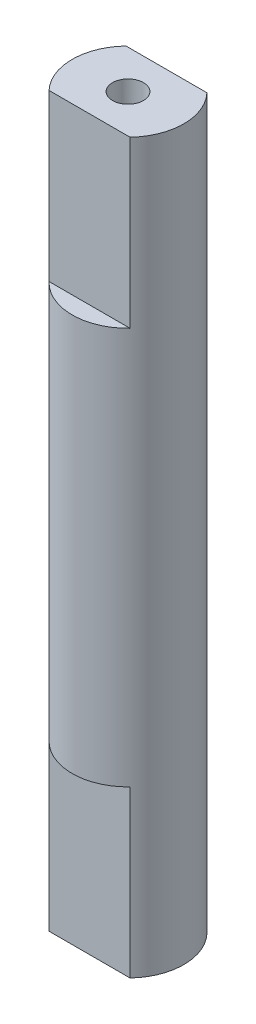
ISO-10303-21;
HEADER;
FILE_DESCRIPTION(('STEP AP214'),'2;1');
FILE_NAME('part.step','',(''),(''),'','','');
FILE_SCHEMA(('AUTOMOTIVE_DESIGN { 1 0 10303 214 1 1 1 1 }'));
ENDSEC;
DATA;
#1=APPLICATION_CONTEXT('core data for automotive mechanical design processes');
#2=APPLICATION_PROTOCOL_DEFINITION('international standard','automotive_design',2000,#1);
#3=PRODUCT_CONTEXT('',#1,'mechanical');
#4=PRODUCT('Part','Part','',(#3));
#5=PRODUCT_RELATED_PRODUCT_CATEGORY('part','',(#4));
#6=PRODUCT_DEFINITION_FORMATION('','',#4);
#7=PRODUCT_DEFINITION_CONTEXT('part definition',#1,'design');
#8=PRODUCT_DEFINITION('design','',#6,#7);
#9=PRODUCT_DEFINITION_SHAPE('','',#8);
#10=(LENGTH_UNIT() NAMED_UNIT(*) SI_UNIT(.MILLI.,.METRE.));
#11=(NAMED_UNIT(*) PLANE_ANGLE_UNIT() SI_UNIT($,.RADIAN.));
#12=(NAMED_UNIT(*) SI_UNIT($,.STERADIAN.) SOLID_ANGLE_UNIT());
#13=UNCERTAINTY_MEASURE_WITH_UNIT(LENGTH_MEASURE(1.E-05),#10,'distance_accuracy_value','');
#14=(GEOMETRIC_REPRESENTATION_CONTEXT(3) GLOBAL_UNCERTAINTY_ASSIGNED_CONTEXT((#13)) GLOBAL_UNIT_ASSIGNED_CONTEXT((#10,
#11,#12)) REPRESENTATION_CONTEXT('',''));
#15=CARTESIAN_POINT('',(0.,0.,0.));
#16=DIRECTION('',(0.,0.,1.));
#17=DIRECTION('',(1.,0.,0.));
#18=AXIS2_PLACEMENT_3D('',#15,#16,#17);
#19=CARTESIAN_POINT('',(0.,24.6045340050378,0.));
#20=DIRECTION('',(0.,1.,0.));
#21=DIRECTION('',(0.,0.,1.));
#22=AXIS2_PLACEMENT_3D('',#19,#20,#21);
#23=CYLINDRICAL_SURFACE('',#22,2.69999999999999);
#24=DIRECTION('',(0.,1.,0.));
#25=VECTOR('',#24,1.);
#26=CARTESIAN_POINT('',(-1.957140771636,24.6045340050378,1.86));
#27=LINE('',#26,#25);
#28=CARTESIAN_POINT('',(-1.957140771636,17.6,1.86));
#29=VERTEX_POINT('',#28);
#30=CARTESIAN_POINT('',(-1.957140771636,9.6,1.86));
#31=VERTEX_POINT('',#30);
#32=EDGE_CURVE('E138',#29,#31,#27,.F.);
#33=ORIENTED_EDGE('',*,*,#32,.F.);
#34=CARTESIAN_POINT('',(0.,17.6,0.));
#35=DIRECTION('',(0.,1.,0.));
#36=DIRECTION('',(0.,0.,1.));
#37=AXIS2_PLACEMENT_3D('',#34,#35,#36);
#38=CIRCLE('',#37,2.69999999999999);
#39=CARTESIAN_POINT('',(-1.957140771636,17.6,-1.86));
#40=VERTEX_POINT('',#39);
#41=EDGE_CURVE('E124',#40,#29,#38,.T.);
#42=ORIENTED_EDGE('',*,*,#41,.F.);
#43=DIRECTION('',(0.,1.,0.));
#44=VECTOR('',#43,1.);
#45=CARTESIAN_POINT('',(-1.957140771636,24.6045340050378,-1.86));
#46=LINE('',#45,#44);
#47=CARTESIAN_POINT('',(-1.957140771636,9.6,-1.86));
#48=VERTEX_POINT('',#47);
#49=EDGE_CURVE('E129',#48,#40,#46,.T.);
#50=ORIENTED_EDGE('',*,*,#49,.F.);
#51=CARTESIAN_POINT('',(0.,9.6,0.));
#52=DIRECTION('',(0.,-1.,0.));
#53=DIRECTION('',(0.,0.,-1.));
#54=AXIS2_PLACEMENT_3D('',#51,#52,#53);
#55=CIRCLE('',#54,2.69999999999999);
#56=CARTESIAN_POINT('',(1.957140771636,9.6,-1.86));
#57=VERTEX_POINT('',#56);
#58=EDGE_CURVE('E127',#57,#48,#55,.F.);
#59=ORIENTED_EDGE('',*,*,#58,.F.);
#60=DIRECTION('',(0.,1.,0.));
#61=VECTOR('',#60,1.);
#62=CARTESIAN_POINT('',(1.957140771636,24.6045340050378,-1.86));
#63=LINE('',#62,#61);
#64=CARTESIAN_POINT('',(1.957140771636,17.6,-1.86));
#65=VERTEX_POINT('',#64);
#66=EDGE_CURVE('E131',#65,#57,#63,.F.);
#67=ORIENTED_EDGE('',*,*,#66,.F.);
#68=CARTESIAN_POINT('',(1.957140771636,17.6,1.86));
#69=VERTEX_POINT('',#68);
#70=EDGE_CURVE('E118',#69,#65,#38,.T.);
#71=ORIENTED_EDGE('',*,*,#70,.F.);
#72=DIRECTION('',(0.,1.,0.));
#73=VECTOR('',#72,1.);
#74=CARTESIAN_POINT('',(1.957140771636,24.6045340050378,1.86));
#75=LINE('',#74,#73);
#76=CARTESIAN_POINT('',(1.957140771636,9.6,1.86));
#77=VERTEX_POINT('',#76);
#78=EDGE_CURVE('E136',#77,#69,#75,.T.);
#79=ORIENTED_EDGE('',*,*,#78,.F.);
#80=CARTESIAN_POINT('',(0.,9.6,0.));
#81=DIRECTION('',(0.,-1.,0.));
#82=DIRECTION('',(0.,0.,-1.));
#83=AXIS2_PLACEMENT_3D('',#80,#81,#82);
#84=CIRCLE('',#83,2.69999999999999);
#85=EDGE_CURVE('E134',#31,#77,#84,.F.);
#86=ORIENTED_EDGE('',*,*,#85,.F.);
#87=EDGE_LOOP('',(#33,#42,#50,#59,#67,#71,#79,#86));
#88=FACE_BOUND('',#87,.T.);
#89=CARTESIAN_POINT('',(0.,-9.6,0.));
#90=DIRECTION('',(0.,1.,0.));
#91=DIRECTION('',(0.,0.,1.));
#92=AXIS2_PLACEMENT_3D('',#89,#90,#91);
#93=CIRCLE('',#92,2.69999999999999);
#94=CARTESIAN_POINT('',(1.957140771636,-9.6,1.86));
#95=VERTEX_POINT('',#94);
#96=CARTESIAN_POINT('',(-1.957140771636,-9.6,1.86));
#97=VERTEX_POINT('',#96);
#98=EDGE_CURVE('E11',#95,#97,#93,.F.);
#99=ORIENTED_EDGE('',*,*,#98,.F.);
#100=DIRECTION('',(0.,1.,0.));
#101=VECTOR('',#100,1.);
#102=CARTESIAN_POINT('',(1.957140771636,24.6045340050378,1.86));
#103=LINE('',#102,#101);
#104=CARTESIAN_POINT('',(1.957140771636,-17.6,1.86));
#105=VERTEX_POINT('',#104);
#106=EDGE_CURVE('E103',#95,#105,#103,.F.);
#107=ORIENTED_EDGE('',*,*,#106,.T.);
#108=CARTESIAN_POINT('',(0.,-17.6,0.));
#109=DIRECTION('',(0.,1.,0.));
#110=DIRECTION('',(0.,0.,1.));
#111=AXIS2_PLACEMENT_3D('',#108,#109,#110);
#112=CIRCLE('',#111,2.69999999999999);
#113=CARTESIAN_POINT('',(1.957140771636,-17.6,-1.86));
#114=VERTEX_POINT('',#113);
#115=EDGE_CURVE('E55',#105,#114,#112,.T.);
#116=ORIENTED_EDGE('',*,*,#115,.T.);
#117=DIRECTION('',(0.,1.,0.));
#118=VECTOR('',#117,1.);
#119=CARTESIAN_POINT('',(1.957140771636,24.6045340050378,-1.86));
#120=LINE('',#119,#118);
#121=CARTESIAN_POINT('',(1.957140771636,-9.6,-1.86));
#122=VERTEX_POINT('',#121);
#123=EDGE_CURVE('E150',#114,#122,#120,.T.);
#124=ORIENTED_EDGE('',*,*,#123,.T.);
#125=CARTESIAN_POINT('',(0.,-9.6,0.));
#126=DIRECTION('',(0.,1.,0.));
#127=DIRECTION('',(0.,0.,1.));
#128=AXIS2_PLACEMENT_3D('',#125,#126,#127);
#129=CIRCLE('',#128,2.69999999999999);
#130=CARTESIAN_POINT('',(-1.957140771636,-9.6,-1.86));
#131=VERTEX_POINT('',#130);
#132=EDGE_CURVE('E108',#131,#122,#129,.F.);
#133=ORIENTED_EDGE('',*,*,#132,.F.);
#134=DIRECTION('',(0.,1.,0.));
#135=VECTOR('',#134,1.);
#136=CARTESIAN_POINT('',(-1.957140771636,24.6045340050378,-1.86));
#137=LINE('',#136,#135);
#138=CARTESIAN_POINT('',(-1.957140771636,-17.6,-1.86));
#139=VERTEX_POINT('',#138);
#140=EDGE_CURVE('E151',#131,#139,#137,.F.);
#141=ORIENTED_EDGE('',*,*,#140,.T.);
#142=CARTESIAN_POINT('',(-1.957140771636,-17.6,1.86));
#143=VERTEX_POINT('',#142);
#144=EDGE_CURVE('E115',#139,#143,#112,.T.);
#145=ORIENTED_EDGE('',*,*,#144,.T.);
#146=DIRECTION('',(0.,1.,0.));
#147=VECTOR('',#146,1.);
#148=CARTESIAN_POINT('',(-1.957140771636,24.6045340050378,1.86));
#149=LINE('',#148,#147);
#150=EDGE_CURVE('E47',#143,#97,#149,.T.);
#151=ORIENTED_EDGE('',*,*,#150,.T.);
#152=EDGE_LOOP('',(#99,#107,#116,#124,#133,#141,#145,#151));
#153=FACE_BOUND('',#152,.T.);
#154=ADVANCED_FACE('F32',(#88,#153),#23,.T.);
#155=CARTESIAN_POINT('',(-2.69999999999999,-17.6,0.));
#156=DIRECTION('',(0.,-1.,0.));
#157=DIRECTION('',(0.,0.,-1.));
#158=AXIS2_PLACEMENT_3D('',#155,#156,#157);
#159=PLANE('',#158);
#160=CARTESIAN_POINT('',(0.,-17.6,0.));
#161=DIRECTION('',(0.,1.,0.));
#162=DIRECTION('',(0.,0.,1.));
#163=AXIS2_PLACEMENT_3D('',#160,#161,#162);
#164=CIRCLE('',#163,0.749999999999991);
#165=CARTESIAN_POINT('',(0.,-17.6,0.749999999999991));
#166=VERTEX_POINT('',#165);
#167=EDGE_CURVE('E116',#166,#166,#164,.T.);
#168=ORIENTED_EDGE('',*,*,#167,.T.);
#169=EDGE_LOOP('',(#168));
#170=FACE_BOUND('',#169,.T.);
#171=ORIENTED_EDGE('',*,*,#115,.F.);
#172=DIRECTION('',(-1.,0.,0.));
#173=VECTOR('',#172,1.);
#174=CARTESIAN_POINT('',(-2.69999999999999,-17.6,1.86));
#175=LINE('',#174,#173);
#176=EDGE_CURVE('E40',#105,#143,#175,.T.);
#177=ORIENTED_EDGE('',*,*,#176,.T.);
#178=ORIENTED_EDGE('',*,*,#144,.F.);
#179=DIRECTION('',(1.,0.,0.));
#180=VECTOR('',#179,1.);
#181=CARTESIAN_POINT('',(-2.69999999999999,-17.6,-1.86));
#182=LINE('',#181,#180);
#183=EDGE_CURVE('E114',#139,#114,#182,.T.);
#184=ORIENTED_EDGE('',*,*,#183,.T.);
#185=EDGE_LOOP('',(#171,#177,#178,#184));
#186=FACE_BOUND('',#185,.T.);
#187=ADVANCED_FACE('F113',(#170,#186),#159,.T.);
#188=CARTESIAN_POINT('',(-0.749999999999998,17.6,0.));
#189=DIRECTION('',(0.,1.,0.));
#190=DIRECTION('',(0.,0.,1.));
#191=AXIS2_PLACEMENT_3D('',#188,#189,#190);
#192=PLANE('',#191);
#193=DIRECTION('',(-1.,0.,0.));
#194=VECTOR('',#193,1.);
#195=CARTESIAN_POINT('',(-2.,17.6,1.86));
#196=LINE('',#195,#194);
#197=EDGE_CURVE('E154',#69,#29,#196,.T.);
#198=ORIENTED_EDGE('',*,*,#197,.F.);
#199=ORIENTED_EDGE('',*,*,#70,.T.);
#200=DIRECTION('',(1.,0.,0.));
#201=VECTOR('',#200,1.);
#202=CARTESIAN_POINT('',(-2.,17.6,-1.86));
#203=LINE('',#202,#201);
#204=EDGE_CURVE('E159',#40,#65,#203,.T.);
#205=ORIENTED_EDGE('',*,*,#204,.F.);
#206=ORIENTED_EDGE('',*,*,#41,.T.);
#207=EDGE_LOOP('',(#198,#199,#205,#206));
#208=FACE_BOUND('',#207,.T.);
#209=CARTESIAN_POINT('',(0.,17.6,0.));
#210=DIRECTION('',(0.,1.,0.));
#211=DIRECTION('',(0.,0.,1.));
#212=AXIS2_PLACEMENT_3D('',#209,#210,#211);
#213=CIRCLE('',#212,0.749999999999998);
#214=CARTESIAN_POINT('',(0.,17.6,0.749999999999998));
#215=VERTEX_POINT('',#214);
#216=EDGE_CURVE('E163',#215,#215,#213,.T.);
#217=ORIENTED_EDGE('',*,*,#216,.F.);
#218=EDGE_LOOP('',(#217));
#219=FACE_BOUND('',#218,.T.);
#220=ADVANCED_FACE('F34',(#208,#219),#192,.T.);
#221=CARTESIAN_POINT('',(0.,24.6045340050378,0.));
#222=DIRECTION('',(0.,1.,0.));
#223=DIRECTION('',(0.,0.,1.));
#224=AXIS2_PLACEMENT_3D('',#221,#222,#223);
#225=CYLINDRICAL_SURFACE('',#224,0.749999999999992);
#226=CARTESIAN_POINT('',(0.,-9.6,0.));
#227=DIRECTION('',(0.,1.,0.));
#228=DIRECTION('',(0.,0.,1.));
#229=AXIS2_PLACEMENT_3D('',#226,#227,#228);
#230=CIRCLE('',#229,0.749999999999994);
#231=CARTESIAN_POINT('',(0.,-9.6,0.749999999999994));
#232=VERTEX_POINT('',#231);
#233=EDGE_CURVE('E120',#232,#232,#230,.T.);
#234=ORIENTED_EDGE('',*,*,#233,.T.);
#235=EDGE_LOOP('',(#234));
#236=FACE_BOUND('',#235,.T.);
#237=ORIENTED_EDGE('',*,*,#167,.F.);
#238=EDGE_LOOP('',(#237));
#239=FACE_BOUND('',#238,.T.);
#240=ADVANCED_FACE('F173',(#236,#239),#225,.F.);
#241=CARTESIAN_POINT('',(0.,-9.6,0.));
#242=DIRECTION('',(0.,-1.,0.));
#243=DIRECTION('',(0.,0.,-1.));
#244=AXIS2_PLACEMENT_3D('',#241,#242,#243);
#245=CONICAL_SURFACE('',#244,0.749999999999994,1.04719755119658);
#246=CARTESIAN_POINT('',(0.,-9.16698729810778,0.));
#247=VERTEX_POINT('',#246);
#248=VERTEX_LOOP('',#247);
#249=FACE_BOUND('',#248,.T.);
#250=ORIENTED_EDGE('',*,*,#233,.F.);
#251=EDGE_LOOP('',(#250));
#252=FACE_BOUND('',#251,.T.);
#253=ADVANCED_FACE('F176',(#249,#252),#245,.F.);
#254=CARTESIAN_POINT('',(0.,9.16698729810778,0.));
#255=DIRECTION('',(0.,1.,0.));
#256=DIRECTION('',(0.,0.,1.));
#257=AXIS2_PLACEMENT_3D('',#254,#255,#256);
#258=CONICAL_SURFACE('',#257,0.,1.04719755119659);
#259=CARTESIAN_POINT('',(0.,9.6,0.));
#260=DIRECTION('',(0.,1.,0.));
#261=DIRECTION('',(0.,0.,1.));
#262=AXIS2_PLACEMENT_3D('',#259,#260,#261);
#263=CIRCLE('',#262,0.749999999999983);
#264=CARTESIAN_POINT('',(0.,9.6,0.749999999999983));
#265=VERTEX_POINT('',#264);
#266=EDGE_CURVE('E168',#265,#265,#263,.T.);
#267=ORIENTED_EDGE('',*,*,#266,.T.);
#268=EDGE_LOOP('',(#267));
#269=FACE_BOUND('',#268,.T.);
#270=CARTESIAN_POINT('',(0.,9.16698729810778,0.));
#271=VERTEX_POINT('',#270);
#272=VERTEX_LOOP('',#271);
#273=FACE_BOUND('',#272,.T.);
#274=ADVANCED_FACE('F178',(#269,#273),#258,.F.);
#275=CARTESIAN_POINT('',(0.,24.6045340050378,0.));
#276=DIRECTION('',(0.,1.,0.));
#277=DIRECTION('',(0.,0.,1.));
#278=AXIS2_PLACEMENT_3D('',#275,#276,#277);
#279=CYLINDRICAL_SURFACE('',#278,0.74999999999999);
#280=ORIENTED_EDGE('',*,*,#216,.T.);
#281=EDGE_LOOP('',(#280));
#282=FACE_BOUND('',#281,.T.);
#283=ORIENTED_EDGE('',*,*,#266,.F.);
#284=EDGE_LOOP('',(#283));
#285=FACE_BOUND('',#284,.T.);
#286=ADVANCED_FACE('F185',(#282,#285),#279,.F.);
#287=CARTESIAN_POINT('',(-2.,9.6,-1.86));
#288=DIRECTION('',(0.,0.,1.));
#289=DIRECTION('',(1.,0.,0.));
#290=AXIS2_PLACEMENT_3D('',#287,#288,#289);
#291=PLANE('',#290);
#292=ORIENTED_EDGE('',*,*,#66,.T.);
#293=DIRECTION('',(1.,0.,0.));
#294=VECTOR('',#293,1.);
#295=CARTESIAN_POINT('',(-2.,9.6,-1.86));
#296=LINE('',#295,#294);
#297=EDGE_CURVE('E161',#48,#57,#296,.T.);
#298=ORIENTED_EDGE('',*,*,#297,.F.);
#299=ORIENTED_EDGE('',*,*,#49,.T.);
#300=ORIENTED_EDGE('',*,*,#204,.T.);
#301=EDGE_LOOP('',(#292,#298,#299,#300));
#302=FACE_BOUND('',#301,.T.);
#303=ADVANCED_FACE('F210',(#302),#291,.F.);
#304=CARTESIAN_POINT('',(0.,9.6,0.));
#305=DIRECTION('',(0.,-1.,0.));
#306=DIRECTION('',(0.,0.,-1.));
#307=AXIS2_PLACEMENT_3D('',#304,#305,#306);
#308=PLANE('',#307);
#309=ORIENTED_EDGE('',*,*,#58,.T.);
#310=ORIENTED_EDGE('',*,*,#297,.T.);
#311=EDGE_LOOP('',(#309,#310));
#312=FACE_BOUND('',#311,.T.);
#313=ADVANCED_FACE('F214',(#312),#308,.F.);
#314=CARTESIAN_POINT('',(-2.,9.6,1.86));
#315=DIRECTION('',(0.,0.,-1.));
#316=DIRECTION('',(-1.,0.,0.));
#317=AXIS2_PLACEMENT_3D('',#314,#315,#316);
#318=PLANE('',#317);
#319=ORIENTED_EDGE('',*,*,#32,.T.);
#320=DIRECTION('',(-1.,0.,0.));
#321=VECTOR('',#320,1.);
#322=CARTESIAN_POINT('',(-2.,9.6,1.86));
#323=LINE('',#322,#321);
#324=EDGE_CURVE('E157',#77,#31,#323,.T.);
#325=ORIENTED_EDGE('',*,*,#324,.F.);
#326=ORIENTED_EDGE('',*,*,#78,.T.);
#327=ORIENTED_EDGE('',*,*,#197,.T.);
#328=EDGE_LOOP('',(#319,#325,#326,#327));
#329=FACE_BOUND('',#328,.T.);
#330=ADVANCED_FACE('F216',(#329),#318,.F.);
#331=CARTESIAN_POINT('',(0.,9.6,0.));
#332=DIRECTION('',(0.,-1.,0.));
#333=DIRECTION('',(0.,0.,-1.));
#334=AXIS2_PLACEMENT_3D('',#331,#332,#333);
#335=PLANE('',#334);
#336=ORIENTED_EDGE('',*,*,#85,.T.);
#337=ORIENTED_EDGE('',*,*,#324,.T.);
#338=EDGE_LOOP('',(#336,#337));
#339=FACE_BOUND('',#338,.T.);
#340=ADVANCED_FACE('F222',(#339),#335,.F.);
#341=CARTESIAN_POINT('',(-2.,-9.6,-1.86));
#342=DIRECTION('',(0.,0.,-1.));
#343=DIRECTION('',(-1.,0.,0.));
#344=AXIS2_PLACEMENT_3D('',#341,#342,#343);
#345=PLANE('',#344);
#346=DIRECTION('',(1.,0.,0.));
#347=VECTOR('',#346,1.);
#348=CARTESIAN_POINT('',(-2.,-9.6,-1.86));
#349=LINE('',#348,#347);
#350=EDGE_CURVE('E110',#131,#122,#349,.T.);
#351=ORIENTED_EDGE('',*,*,#350,.T.);
#352=ORIENTED_EDGE('',*,*,#123,.F.);
#353=ORIENTED_EDGE('',*,*,#183,.F.);
#354=ORIENTED_EDGE('',*,*,#140,.F.);
#355=EDGE_LOOP('',(#351,#352,#353,#354));
#356=FACE_BOUND('',#355,.T.);
#357=ADVANCED_FACE('F149',(#356),#345,.T.);
#358=CARTESIAN_POINT('',(0.,-9.6,0.));
#359=DIRECTION('',(0.,1.,0.));
#360=DIRECTION('',(0.,0.,-1.));
#361=AXIS2_PLACEMENT_3D('',#358,#359,#360);
#362=PLANE('',#361);
#363=ORIENTED_EDGE('',*,*,#132,.T.);
#364=ORIENTED_EDGE('',*,*,#350,.F.);
#365=EDGE_LOOP('',(#363,#364));
#366=FACE_BOUND('',#365,.T.);
#367=ADVANCED_FACE('F146',(#366),#362,.F.);
#368=CARTESIAN_POINT('',(-2.,-9.6,1.86));
#369=DIRECTION('',(0.,0.,1.));
#370=DIRECTION('',(1.,0.,0.));
#371=AXIS2_PLACEMENT_3D('',#368,#369,#370);
#372=PLANE('',#371);
#373=DIRECTION('',(-1.,0.,0.));
#374=VECTOR('',#373,1.);
#375=CARTESIAN_POINT('',(-2.,-9.6,1.86));
#376=LINE('',#375,#374);
#377=EDGE_CURVE('E327',#95,#97,#376,.T.);
#378=ORIENTED_EDGE('',*,*,#377,.T.);
#379=ORIENTED_EDGE('',*,*,#150,.F.);
#380=ORIENTED_EDGE('',*,*,#176,.F.);
#381=ORIENTED_EDGE('',*,*,#106,.F.);
#382=EDGE_LOOP('',(#378,#379,#380,#381));
#383=FACE_BOUND('',#382,.T.);
#384=ADVANCED_FACE('F102',(#383),#372,.T.);
#385=CARTESIAN_POINT('',(0.,-9.6,0.));
#386=DIRECTION('',(0.,1.,0.));
#387=DIRECTION('',(0.,0.,-1.));
#388=AXIS2_PLACEMENT_3D('',#385,#386,#387);
#389=PLANE('',#388);
#390=ORIENTED_EDGE('',*,*,#98,.T.);
#391=ORIENTED_EDGE('',*,*,#377,.F.);
#392=EDGE_LOOP('',(#390,#391));
#393=FACE_BOUND('',#392,.T.);
#394=ADVANCED_FACE('F311',(#393),#389,.F.);
#395=CLOSED_SHELL('',(#154,#187,#220,#240,#253,#274,#286,#303,#313,#330,#340,#357,#367,#384,#394));
#396=MANIFOLD_SOLID_BREP('B2',#395);
#397=ADVANCED_BREP_SHAPE_REPRESENTATION('',(#18,#396),#14);
#398=SHAPE_DEFINITION_REPRESENTATION(#9,#397);
ENDSEC;
END-ISO-10303-21;
